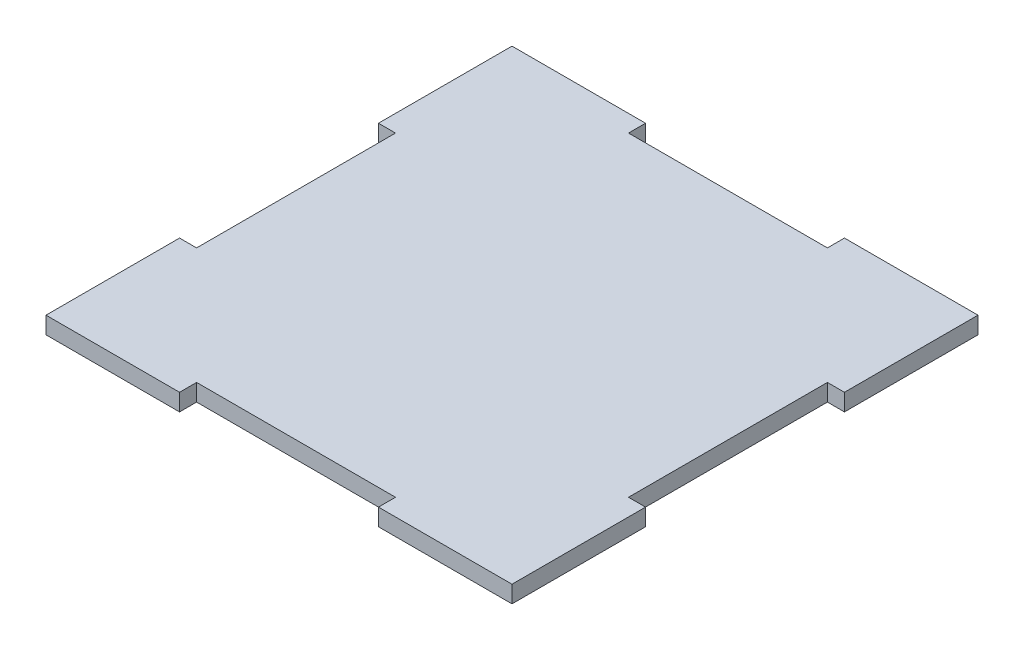
ISO-10303-21;
HEADER;
FILE_DESCRIPTION(('STEP AP214'),'2;1');
FILE_NAME('part.step','',(''),(''),'','','');
FILE_SCHEMA(('AUTOMOTIVE_DESIGN { 1 0 10303 214 1 1 1 1 }'));
ENDSEC;
DATA;
#1=APPLICATION_CONTEXT('core data for automotive mechanical design processes');
#2=APPLICATION_PROTOCOL_DEFINITION('international standard','automotive_design',2000,#1);
#3=PRODUCT_CONTEXT('',#1,'mechanical');
#4=PRODUCT('Part','Part','',(#3));
#5=PRODUCT_RELATED_PRODUCT_CATEGORY('part','',(#4));
#6=PRODUCT_DEFINITION_FORMATION('','',#4);
#7=PRODUCT_DEFINITION_CONTEXT('part definition',#1,'design');
#8=PRODUCT_DEFINITION('design','',#6,#7);
#9=PRODUCT_DEFINITION_SHAPE('','',#8);
#10=(LENGTH_UNIT() NAMED_UNIT(*) SI_UNIT(.MILLI.,.METRE.));
#11=(NAMED_UNIT(*) PLANE_ANGLE_UNIT() SI_UNIT($,.RADIAN.));
#12=(NAMED_UNIT(*) SI_UNIT($,.STERADIAN.) SOLID_ANGLE_UNIT());
#13=UNCERTAINTY_MEASURE_WITH_UNIT(LENGTH_MEASURE(1.E-05),#10,'distance_accuracy_value','');
#14=(GEOMETRIC_REPRESENTATION_CONTEXT(3) GLOBAL_UNCERTAINTY_ASSIGNED_CONTEXT((#13)) GLOBAL_UNIT_ASSIGNED_CONTEXT((#10,
#11,#12)) REPRESENTATION_CONTEXT('',''));
#15=CARTESIAN_POINT('',(0.,0.,0.));
#16=DIRECTION('',(0.,0.,1.));
#17=DIRECTION('',(1.,0.,0.));
#18=AXIS2_PLACEMENT_3D('',#15,#16,#17);
#19=CARTESIAN_POINT('',(41.,3.,-17.5));
#20=DIRECTION('',(-1.,0.,0.));
#21=DIRECTION('',(0.,0.,1.));
#22=AXIS2_PLACEMENT_3D('',#19,#20,#21);
#23=PLANE('',#22);
#24=DIRECTION('',(0.,0.,-1.));
#25=VECTOR('',#24,1.);
#26=CARTESIAN_POINT('',(41.,0.,-17.5));
#27=LINE('',#26,#25);
#28=CARTESIAN_POINT('',(41.,0.,-17.5));
#29=VERTEX_POINT('',#28);
#30=CARTESIAN_POINT('',(41.,0.,-41.));
#31=VERTEX_POINT('',#30);
#32=EDGE_CURVE('E204',#29,#31,#27,.T.);
#33=ORIENTED_EDGE('',*,*,#32,.T.);
#34=DIRECTION('',(0.,-1.,0.));
#35=VECTOR('',#34,1.);
#36=CARTESIAN_POINT('',(41.,3.,-41.));
#37=LINE('',#36,#35);
#38=CARTESIAN_POINT('',(41.,3.,-41.));
#39=VERTEX_POINT('',#38);
#40=EDGE_CURVE('E11',#39,#31,#37,.T.);
#41=ORIENTED_EDGE('',*,*,#40,.F.);
#42=DIRECTION('',(0.,0.,-1.));
#43=VECTOR('',#42,1.);
#44=CARTESIAN_POINT('',(41.,3.,-17.5));
#45=LINE('',#44,#43);
#46=CARTESIAN_POINT('',(41.,3.,-17.5));
#47=VERTEX_POINT('',#46);
#48=EDGE_CURVE('E242',#47,#39,#45,.T.);
#49=ORIENTED_EDGE('',*,*,#48,.F.);
#50=DIRECTION('',(0.,-1.,0.));
#51=VECTOR('',#50,1.);
#52=CARTESIAN_POINT('',(41.,3.,-17.5));
#53=LINE('',#52,#51);
#54=EDGE_CURVE('E200',#47,#29,#53,.T.);
#55=ORIENTED_EDGE('',*,*,#54,.T.);
#56=EDGE_LOOP('',(#33,#41,#49,#55));
#57=FACE_BOUND('',#56,.T.);
#58=ADVANCED_FACE('F36',(#57),#23,.F.);
#59=CARTESIAN_POINT('',(17.5,3.,-41.));
#60=DIRECTION('',(0.,0.,1.));
#61=DIRECTION('',(1.,0.,0.));
#62=AXIS2_PLACEMENT_3D('',#59,#60,#61);
#63=PLANE('',#62);
#64=DIRECTION('',(-1.,0.,0.));
#65=VECTOR('',#64,1.);
#66=CARTESIAN_POINT('',(17.5,0.,-41.));
#67=LINE('',#66,#65);
#68=CARTESIAN_POINT('',(17.5,0.,-41.));
#69=VERTEX_POINT('',#68);
#70=EDGE_CURVE('E207',#31,#69,#67,.T.);
#71=ORIENTED_EDGE('',*,*,#70,.T.);
#72=DIRECTION('',(0.,-1.,0.));
#73=VECTOR('',#72,1.);
#74=CARTESIAN_POINT('',(17.5,3.,-41.));
#75=LINE('',#74,#73);
#76=CARTESIAN_POINT('',(17.5,3.,-41.));
#77=VERTEX_POINT('',#76);
#78=EDGE_CURVE('E44',#77,#69,#75,.T.);
#79=ORIENTED_EDGE('',*,*,#78,.F.);
#80=DIRECTION('',(-1.,0.,0.));
#81=VECTOR('',#80,1.);
#82=CARTESIAN_POINT('',(17.5,3.,-41.));
#83=LINE('',#82,#81);
#84=EDGE_CURVE('E131',#39,#77,#83,.T.);
#85=ORIENTED_EDGE('',*,*,#84,.F.);
#86=ORIENTED_EDGE('',*,*,#40,.T.);
#87=EDGE_LOOP('',(#71,#79,#85,#86));
#88=FACE_BOUND('',#87,.T.);
#89=ADVANCED_FACE('F360',(#88),#63,.F.);
#90=CARTESIAN_POINT('',(17.5,3.,-38.));
#91=DIRECTION('',(1.,0.,0.));
#92=DIRECTION('',(0.,0.,-1.));
#93=AXIS2_PLACEMENT_3D('',#90,#91,#92);
#94=PLANE('',#93);
#95=DIRECTION('',(0.,0.,1.));
#96=VECTOR('',#95,1.);
#97=CARTESIAN_POINT('',(17.5,0.,-38.));
#98=LINE('',#97,#96);
#99=CARTESIAN_POINT('',(17.5,0.,-38.));
#100=VERTEX_POINT('',#99);
#101=EDGE_CURVE('E209',#69,#100,#98,.T.);
#102=ORIENTED_EDGE('',*,*,#101,.T.);
#103=DIRECTION('',(0.,-1.,0.));
#104=VECTOR('',#103,1.);
#105=CARTESIAN_POINT('',(17.5,3.,-38.));
#106=LINE('',#105,#104);
#107=CARTESIAN_POINT('',(17.5,3.,-38.));
#108=VERTEX_POINT('',#107);
#109=EDGE_CURVE('E285',#108,#100,#106,.T.);
#110=ORIENTED_EDGE('',*,*,#109,.F.);
#111=DIRECTION('',(0.,0.,1.));
#112=VECTOR('',#111,1.);
#113=CARTESIAN_POINT('',(17.5,3.,-38.));
#114=LINE('',#113,#112);
#115=EDGE_CURVE('E293',#77,#108,#114,.T.);
#116=ORIENTED_EDGE('',*,*,#115,.F.);
#117=ORIENTED_EDGE('',*,*,#78,.T.);
#118=EDGE_LOOP('',(#102,#110,#116,#117));
#119=FACE_BOUND('',#118,.T.);
#120=ADVANCED_FACE('F291',(#119),#94,.F.);
#121=CARTESIAN_POINT('',(-17.5,3.,-38.));
#122=DIRECTION('',(0.,0.,1.));
#123=DIRECTION('',(1.,0.,0.));
#124=AXIS2_PLACEMENT_3D('',#121,#122,#123);
#125=PLANE('',#124);
#126=DIRECTION('',(-1.,0.,0.));
#127=VECTOR('',#126,1.);
#128=CARTESIAN_POINT('',(-17.5,0.,-38.));
#129=LINE('',#128,#127);
#130=CARTESIAN_POINT('',(-17.5,0.,-38.));
#131=VERTEX_POINT('',#130);
#132=EDGE_CURVE('E211',#100,#131,#129,.T.);
#133=ORIENTED_EDGE('',*,*,#132,.T.);
#134=DIRECTION('',(0.,-1.,0.));
#135=VECTOR('',#134,1.);
#136=CARTESIAN_POINT('',(-17.5,3.,-38.));
#137=LINE('',#136,#135);
#138=CARTESIAN_POINT('',(-17.5,3.,-38.));
#139=VERTEX_POINT('',#138);
#140=EDGE_CURVE('E282',#139,#131,#137,.T.);
#141=ORIENTED_EDGE('',*,*,#140,.F.);
#142=DIRECTION('',(-1.,0.,0.));
#143=VECTOR('',#142,1.);
#144=CARTESIAN_POINT('',(-17.5,3.,-38.));
#145=LINE('',#144,#143);
#146=EDGE_CURVE('E311',#108,#139,#145,.T.);
#147=ORIENTED_EDGE('',*,*,#146,.F.);
#148=ORIENTED_EDGE('',*,*,#109,.T.);
#149=EDGE_LOOP('',(#133,#141,#147,#148));
#150=FACE_BOUND('',#149,.T.);
#151=ADVANCED_FACE('F302',(#150),#125,.F.);
#152=CARTESIAN_POINT('',(-17.5,3.,-41.));
#153=DIRECTION('',(-1.,0.,0.));
#154=DIRECTION('',(0.,0.,1.));
#155=AXIS2_PLACEMENT_3D('',#152,#153,#154);
#156=PLANE('',#155);
#157=DIRECTION('',(0.,0.,-1.));
#158=VECTOR('',#157,1.);
#159=CARTESIAN_POINT('',(-17.5,0.,-41.));
#160=LINE('',#159,#158);
#161=CARTESIAN_POINT('',(-17.5,0.,-41.));
#162=VERTEX_POINT('',#161);
#163=EDGE_CURVE('E213',#131,#162,#160,.T.);
#164=ORIENTED_EDGE('',*,*,#163,.T.);
#165=DIRECTION('',(0.,-1.,0.));
#166=VECTOR('',#165,1.);
#167=CARTESIAN_POINT('',(-17.5,3.,-41.));
#168=LINE('',#167,#166);
#169=CARTESIAN_POINT('',(-17.5,3.,-41.));
#170=VERTEX_POINT('',#169);
#171=EDGE_CURVE('E279',#170,#162,#168,.T.);
#172=ORIENTED_EDGE('',*,*,#171,.F.);
#173=DIRECTION('',(0.,0.,-1.));
#174=VECTOR('',#173,1.);
#175=CARTESIAN_POINT('',(-17.5,3.,-41.));
#176=LINE('',#175,#174);
#177=EDGE_CURVE('E308',#139,#170,#176,.T.);
#178=ORIENTED_EDGE('',*,*,#177,.F.);
#179=ORIENTED_EDGE('',*,*,#140,.T.);
#180=EDGE_LOOP('',(#164,#172,#178,#179));
#181=FACE_BOUND('',#180,.T.);
#182=ADVANCED_FACE('F306',(#181),#156,.F.);
#183=CARTESIAN_POINT('',(-41.,3.,-41.));
#184=DIRECTION('',(0.,0.,1.));
#185=DIRECTION('',(1.,0.,0.));
#186=AXIS2_PLACEMENT_3D('',#183,#184,#185);
#187=PLANE('',#186);
#188=DIRECTION('',(-1.,0.,0.));
#189=VECTOR('',#188,1.);
#190=CARTESIAN_POINT('',(-41.,0.,-41.));
#191=LINE('',#190,#189);
#192=CARTESIAN_POINT('',(-41.,0.,-41.));
#193=VERTEX_POINT('',#192);
#194=EDGE_CURVE('E215',#162,#193,#191,.T.);
#195=ORIENTED_EDGE('',*,*,#194,.T.);
#196=DIRECTION('',(0.,-1.,0.));
#197=VECTOR('',#196,1.);
#198=CARTESIAN_POINT('',(-41.,3.,-41.));
#199=LINE('',#198,#197);
#200=CARTESIAN_POINT('',(-41.,3.,-41.));
#201=VERTEX_POINT('',#200);
#202=EDGE_CURVE('E276',#201,#193,#199,.T.);
#203=ORIENTED_EDGE('',*,*,#202,.F.);
#204=DIRECTION('',(-1.,0.,0.));
#205=VECTOR('',#204,1.);
#206=CARTESIAN_POINT('',(-41.,3.,-41.));
#207=LINE('',#206,#205);
#208=EDGE_CURVE('E310',#170,#201,#207,.T.);
#209=ORIENTED_EDGE('',*,*,#208,.F.);
#210=ORIENTED_EDGE('',*,*,#171,.T.);
#211=EDGE_LOOP('',(#195,#203,#209,#210));
#212=FACE_BOUND('',#211,.T.);
#213=ADVANCED_FACE('F373',(#212),#187,.F.);
#214=CARTESIAN_POINT('',(-41.,3.,-17.5));
#215=DIRECTION('',(1.,0.,0.));
#216=DIRECTION('',(0.,0.,-1.));
#217=AXIS2_PLACEMENT_3D('',#214,#215,#216);
#218=PLANE('',#217);
#219=DIRECTION('',(0.,0.,1.));
#220=VECTOR('',#219,1.);
#221=CARTESIAN_POINT('',(-41.,0.,-17.5));
#222=LINE('',#221,#220);
#223=CARTESIAN_POINT('',(-41.,0.,-17.5));
#224=VERTEX_POINT('',#223);
#225=EDGE_CURVE('E217',#193,#224,#222,.T.);
#226=ORIENTED_EDGE('',*,*,#225,.T.);
#227=DIRECTION('',(0.,-1.,0.));
#228=VECTOR('',#227,1.);
#229=CARTESIAN_POINT('',(-41.,3.,-17.5));
#230=LINE('',#229,#228);
#231=CARTESIAN_POINT('',(-41.,3.,-17.5));
#232=VERTEX_POINT('',#231);
#233=EDGE_CURVE('E273',#232,#224,#230,.T.);
#234=ORIENTED_EDGE('',*,*,#233,.F.);
#235=DIRECTION('',(0.,0.,1.));
#236=VECTOR('',#235,1.);
#237=CARTESIAN_POINT('',(-41.,3.,-17.5));
#238=LINE('',#237,#236);
#239=EDGE_CURVE('E313',#201,#232,#238,.T.);
#240=ORIENTED_EDGE('',*,*,#239,.F.);
#241=ORIENTED_EDGE('',*,*,#202,.T.);
#242=EDGE_LOOP('',(#226,#234,#240,#241));
#243=FACE_BOUND('',#242,.T.);
#244=ADVANCED_FACE('F376',(#243),#218,.F.);
#245=CARTESIAN_POINT('',(-41.,3.,-17.5));
#246=DIRECTION('',(0.,0.,-1.));
#247=DIRECTION('',(-1.,0.,0.));
#248=AXIS2_PLACEMENT_3D('',#245,#246,#247);
#249=PLANE('',#248);
#250=DIRECTION('',(1.,0.,0.));
#251=VECTOR('',#250,1.);
#252=CARTESIAN_POINT('',(-41.,0.,-17.5));
#253=LINE('',#252,#251);
#254=CARTESIAN_POINT('',(-38.,0.,-17.5));
#255=VERTEX_POINT('',#254);
#256=EDGE_CURVE('E219',#224,#255,#253,.T.);
#257=ORIENTED_EDGE('',*,*,#256,.T.);
#258=DIRECTION('',(0.,-1.,0.));
#259=VECTOR('',#258,1.);
#260=CARTESIAN_POINT('',(-38.,3.,-17.5));
#261=LINE('',#260,#259);
#262=CARTESIAN_POINT('',(-38.,3.,-17.5));
#263=VERTEX_POINT('',#262);
#264=EDGE_CURVE('E270',#263,#255,#261,.T.);
#265=ORIENTED_EDGE('',*,*,#264,.F.);
#266=DIRECTION('',(1.,0.,0.));
#267=VECTOR('',#266,1.);
#268=CARTESIAN_POINT('',(-41.,3.,-17.5));
#269=LINE('',#268,#267);
#270=EDGE_CURVE('E319',#232,#263,#269,.T.);
#271=ORIENTED_EDGE('',*,*,#270,.F.);
#272=ORIENTED_EDGE('',*,*,#233,.T.);
#273=EDGE_LOOP('',(#257,#265,#271,#272));
#274=FACE_BOUND('',#273,.T.);
#275=ADVANCED_FACE('F380',(#274),#249,.F.);
#276=CARTESIAN_POINT('',(-38.,3.,-17.5));
#277=DIRECTION('',(1.,0.,0.));
#278=DIRECTION('',(0.,0.,-1.));
#279=AXIS2_PLACEMENT_3D('',#276,#277,#278);
#280=PLANE('',#279);
#281=DIRECTION('',(0.,0.,1.));
#282=VECTOR('',#281,1.);
#283=CARTESIAN_POINT('',(-38.,0.,-17.5));
#284=LINE('',#283,#282);
#285=CARTESIAN_POINT('',(-38.,0.,17.5));
#286=VERTEX_POINT('',#285);
#287=EDGE_CURVE('E221',#255,#286,#284,.T.);
#288=ORIENTED_EDGE('',*,*,#287,.T.);
#289=DIRECTION('',(0.,-1.,0.));
#290=VECTOR('',#289,1.);
#291=CARTESIAN_POINT('',(-38.,3.,17.5));
#292=LINE('',#291,#290);
#293=CARTESIAN_POINT('',(-38.,3.,17.5));
#294=VERTEX_POINT('',#293);
#295=EDGE_CURVE('E267',#294,#286,#292,.T.);
#296=ORIENTED_EDGE('',*,*,#295,.F.);
#297=DIRECTION('',(0.,0.,1.));
#298=VECTOR('',#297,1.);
#299=CARTESIAN_POINT('',(-38.,3.,-17.5));
#300=LINE('',#299,#298);
#301=EDGE_CURVE('E321',#263,#294,#300,.T.);
#302=ORIENTED_EDGE('',*,*,#301,.F.);
#303=ORIENTED_EDGE('',*,*,#264,.T.);
#304=EDGE_LOOP('',(#288,#296,#302,#303));
#305=FACE_BOUND('',#304,.T.);
#306=ADVANCED_FACE('F384',(#305),#280,.F.);
#307=CARTESIAN_POINT('',(-38.,3.,17.5));
#308=DIRECTION('',(0.,0.,1.));
#309=DIRECTION('',(1.,0.,0.));
#310=AXIS2_PLACEMENT_3D('',#307,#308,#309);
#311=PLANE('',#310);
#312=DIRECTION('',(-1.,0.,0.));
#313=VECTOR('',#312,1.);
#314=CARTESIAN_POINT('',(-38.,0.,17.5));
#315=LINE('',#314,#313);
#316=CARTESIAN_POINT('',(-41.,0.,17.5));
#317=VERTEX_POINT('',#316);
#318=EDGE_CURVE('E223',#286,#317,#315,.T.);
#319=ORIENTED_EDGE('',*,*,#318,.T.);
#320=DIRECTION('',(0.,-1.,0.));
#321=VECTOR('',#320,1.);
#322=CARTESIAN_POINT('',(-41.,3.,17.5));
#323=LINE('',#322,#321);
#324=CARTESIAN_POINT('',(-41.,3.,17.5));
#325=VERTEX_POINT('',#324);
#326=EDGE_CURVE('E264',#325,#317,#323,.T.);
#327=ORIENTED_EDGE('',*,*,#326,.F.);
#328=DIRECTION('',(-1.,0.,0.));
#329=VECTOR('',#328,1.);
#330=CARTESIAN_POINT('',(-38.,3.,17.5));
#331=LINE('',#330,#329);
#332=EDGE_CURVE('E323',#294,#325,#331,.T.);
#333=ORIENTED_EDGE('',*,*,#332,.F.);
#334=ORIENTED_EDGE('',*,*,#295,.T.);
#335=EDGE_LOOP('',(#319,#327,#333,#334));
#336=FACE_BOUND('',#335,.T.);
#337=ADVANCED_FACE('F388',(#336),#311,.F.);
#338=CARTESIAN_POINT('',(-41.,3.,41.));
#339=DIRECTION('',(1.,0.,0.));
#340=DIRECTION('',(0.,0.,-1.));
#341=AXIS2_PLACEMENT_3D('',#338,#339,#340);
#342=PLANE('',#341);
#343=DIRECTION('',(0.,0.,1.));
#344=VECTOR('',#343,1.);
#345=CARTESIAN_POINT('',(-41.,0.,41.));
#346=LINE('',#345,#344);
#347=CARTESIAN_POINT('',(-41.,0.,41.));
#348=VERTEX_POINT('',#347);
#349=EDGE_CURVE('E225',#317,#348,#346,.T.);
#350=ORIENTED_EDGE('',*,*,#349,.T.);
#351=DIRECTION('',(0.,-1.,0.));
#352=VECTOR('',#351,1.);
#353=CARTESIAN_POINT('',(-41.,3.,41.));
#354=LINE('',#353,#352);
#355=CARTESIAN_POINT('',(-41.,3.,41.));
#356=VERTEX_POINT('',#355);
#357=EDGE_CURVE('E261',#356,#348,#354,.T.);
#358=ORIENTED_EDGE('',*,*,#357,.F.);
#359=DIRECTION('',(0.,0.,1.));
#360=VECTOR('',#359,1.);
#361=CARTESIAN_POINT('',(-41.,3.,41.));
#362=LINE('',#361,#360);
#363=EDGE_CURVE('E325',#325,#356,#362,.T.);
#364=ORIENTED_EDGE('',*,*,#363,.F.);
#365=ORIENTED_EDGE('',*,*,#326,.T.);
#366=EDGE_LOOP('',(#350,#358,#364,#365));
#367=FACE_BOUND('',#366,.T.);
#368=ADVANCED_FACE('F392',(#367),#342,.F.);
#369=CARTESIAN_POINT('',(-41.,3.,41.));
#370=DIRECTION('',(0.,0.,-1.));
#371=DIRECTION('',(-1.,0.,0.));
#372=AXIS2_PLACEMENT_3D('',#369,#370,#371);
#373=PLANE('',#372);
#374=DIRECTION('',(1.,0.,0.));
#375=VECTOR('',#374,1.);
#376=CARTESIAN_POINT('',(-41.,0.,41.));
#377=LINE('',#376,#375);
#378=CARTESIAN_POINT('',(-17.5,0.,41.));
#379=VERTEX_POINT('',#378);
#380=EDGE_CURVE('E227',#348,#379,#377,.T.);
#381=ORIENTED_EDGE('',*,*,#380,.T.);
#382=DIRECTION('',(0.,-1.,0.));
#383=VECTOR('',#382,1.);
#384=CARTESIAN_POINT('',(-17.5,3.,41.));
#385=LINE('',#384,#383);
#386=CARTESIAN_POINT('',(-17.5,3.,41.));
#387=VERTEX_POINT('',#386);
#388=EDGE_CURVE('E258',#387,#379,#385,.T.);
#389=ORIENTED_EDGE('',*,*,#388,.F.);
#390=DIRECTION('',(1.,0.,0.));
#391=VECTOR('',#390,1.);
#392=CARTESIAN_POINT('',(-41.,3.,41.));
#393=LINE('',#392,#391);
#394=EDGE_CURVE('E327',#356,#387,#393,.T.);
#395=ORIENTED_EDGE('',*,*,#394,.F.);
#396=ORIENTED_EDGE('',*,*,#357,.T.);
#397=EDGE_LOOP('',(#381,#389,#395,#396));
#398=FACE_BOUND('',#397,.T.);
#399=ADVANCED_FACE('F396',(#398),#373,.F.);
#400=CARTESIAN_POINT('',(-17.5,3.,38.));
#401=DIRECTION('',(-1.,0.,0.));
#402=DIRECTION('',(0.,0.,1.));
#403=AXIS2_PLACEMENT_3D('',#400,#401,#402);
#404=PLANE('',#403);
#405=DIRECTION('',(0.,0.,-1.));
#406=VECTOR('',#405,1.);
#407=CARTESIAN_POINT('',(-17.5,0.,38.));
#408=LINE('',#407,#406);
#409=CARTESIAN_POINT('',(-17.5,0.,38.));
#410=VERTEX_POINT('',#409);
#411=EDGE_CURVE('E229',#379,#410,#408,.T.);
#412=ORIENTED_EDGE('',*,*,#411,.T.);
#413=DIRECTION('',(0.,-1.,0.));
#414=VECTOR('',#413,1.);
#415=CARTESIAN_POINT('',(-17.5,3.,38.));
#416=LINE('',#415,#414);
#417=CARTESIAN_POINT('',(-17.5,3.,38.));
#418=VERTEX_POINT('',#417);
#419=EDGE_CURVE('E255',#418,#410,#416,.T.);
#420=ORIENTED_EDGE('',*,*,#419,.F.);
#421=DIRECTION('',(0.,0.,-1.));
#422=VECTOR('',#421,1.);
#423=CARTESIAN_POINT('',(-17.5,3.,38.));
#424=LINE('',#423,#422);
#425=EDGE_CURVE('E329',#387,#418,#424,.T.);
#426=ORIENTED_EDGE('',*,*,#425,.F.);
#427=ORIENTED_EDGE('',*,*,#388,.T.);
#428=EDGE_LOOP('',(#412,#420,#426,#427));
#429=FACE_BOUND('',#428,.T.);
#430=ADVANCED_FACE('F400',(#429),#404,.F.);
#431=CARTESIAN_POINT('',(17.5,3.,38.));
#432=DIRECTION('',(0.,0.,-1.));
#433=DIRECTION('',(-1.,0.,0.));
#434=AXIS2_PLACEMENT_3D('',#431,#432,#433);
#435=PLANE('',#434);
#436=DIRECTION('',(1.,0.,0.));
#437=VECTOR('',#436,1.);
#438=CARTESIAN_POINT('',(17.5,0.,38.));
#439=LINE('',#438,#437);
#440=CARTESIAN_POINT('',(17.5,0.,38.));
#441=VERTEX_POINT('',#440);
#442=EDGE_CURVE('E231',#410,#441,#439,.T.);
#443=ORIENTED_EDGE('',*,*,#442,.T.);
#444=DIRECTION('',(0.,-1.,0.));
#445=VECTOR('',#444,1.);
#446=CARTESIAN_POINT('',(17.5,3.,38.));
#447=LINE('',#446,#445);
#448=CARTESIAN_POINT('',(17.5,3.,38.));
#449=VERTEX_POINT('',#448);
#450=EDGE_CURVE('E252',#449,#441,#447,.T.);
#451=ORIENTED_EDGE('',*,*,#450,.F.);
#452=DIRECTION('',(1.,0.,0.));
#453=VECTOR('',#452,1.);
#454=CARTESIAN_POINT('',(17.5,3.,38.));
#455=LINE('',#454,#453);
#456=EDGE_CURVE('E331',#418,#449,#455,.T.);
#457=ORIENTED_EDGE('',*,*,#456,.F.);
#458=ORIENTED_EDGE('',*,*,#419,.T.);
#459=EDGE_LOOP('',(#443,#451,#457,#458));
#460=FACE_BOUND('',#459,.T.);
#461=ADVANCED_FACE('F404',(#460),#435,.F.);
#462=CARTESIAN_POINT('',(17.5,3.,41.));
#463=DIRECTION('',(1.,0.,0.));
#464=DIRECTION('',(0.,0.,-1.));
#465=AXIS2_PLACEMENT_3D('',#462,#463,#464);
#466=PLANE('',#465);
#467=DIRECTION('',(0.,0.,1.));
#468=VECTOR('',#467,1.);
#469=CARTESIAN_POINT('',(17.5,0.,41.));
#470=LINE('',#469,#468);
#471=CARTESIAN_POINT('',(17.5,0.,41.));
#472=VERTEX_POINT('',#471);
#473=EDGE_CURVE('E233',#441,#472,#470,.T.);
#474=ORIENTED_EDGE('',*,*,#473,.T.);
#475=DIRECTION('',(0.,-1.,0.));
#476=VECTOR('',#475,1.);
#477=CARTESIAN_POINT('',(17.5,3.,41.));
#478=LINE('',#477,#476);
#479=CARTESIAN_POINT('',(17.5,3.,41.));
#480=VERTEX_POINT('',#479);
#481=EDGE_CURVE('E249',#480,#472,#478,.T.);
#482=ORIENTED_EDGE('',*,*,#481,.F.);
#483=DIRECTION('',(0.,0.,1.));
#484=VECTOR('',#483,1.);
#485=CARTESIAN_POINT('',(17.5,3.,41.));
#486=LINE('',#485,#484);
#487=EDGE_CURVE('E333',#449,#480,#486,.T.);
#488=ORIENTED_EDGE('',*,*,#487,.F.);
#489=ORIENTED_EDGE('',*,*,#450,.T.);
#490=EDGE_LOOP('',(#474,#482,#488,#489));
#491=FACE_BOUND('',#490,.T.);
#492=ADVANCED_FACE('F408',(#491),#466,.F.);
#493=CARTESIAN_POINT('',(17.5,3.,41.));
#494=DIRECTION('',(0.,0.,-1.));
#495=DIRECTION('',(-1.,0.,0.));
#496=AXIS2_PLACEMENT_3D('',#493,#494,#495);
#497=PLANE('',#496);
#498=DIRECTION('',(1.,0.,0.));
#499=VECTOR('',#498,1.);
#500=CARTESIAN_POINT('',(17.5,0.,41.));
#501=LINE('',#500,#499);
#502=CARTESIAN_POINT('',(41.,0.,41.));
#503=VERTEX_POINT('',#502);
#504=EDGE_CURVE('E235',#472,#503,#501,.T.);
#505=ORIENTED_EDGE('',*,*,#504,.T.);
#506=DIRECTION('',(0.,-1.,0.));
#507=VECTOR('',#506,1.);
#508=CARTESIAN_POINT('',(41.,3.,41.));
#509=LINE('',#508,#507);
#510=CARTESIAN_POINT('',(41.,3.,41.));
#511=VERTEX_POINT('',#510);
#512=EDGE_CURVE('E246',#511,#503,#509,.T.);
#513=ORIENTED_EDGE('',*,*,#512,.F.);
#514=DIRECTION('',(1.,0.,0.));
#515=VECTOR('',#514,1.);
#516=CARTESIAN_POINT('',(17.5,3.,41.));
#517=LINE('',#516,#515);
#518=EDGE_CURVE('E335',#480,#511,#517,.T.);
#519=ORIENTED_EDGE('',*,*,#518,.F.);
#520=ORIENTED_EDGE('',*,*,#481,.T.);
#521=EDGE_LOOP('',(#505,#513,#519,#520));
#522=FACE_BOUND('',#521,.T.);
#523=ADVANCED_FACE('F341',(#522),#497,.F.);
#524=CARTESIAN_POINT('',(41.,3.,41.));
#525=DIRECTION('',(-1.,0.,0.));
#526=DIRECTION('',(0.,0.,1.));
#527=AXIS2_PLACEMENT_3D('',#524,#525,#526);
#528=PLANE('',#527);
#529=DIRECTION('',(0.,0.,-1.));
#530=VECTOR('',#529,1.);
#531=CARTESIAN_POINT('',(41.,0.,41.));
#532=LINE('',#531,#530);
#533=CARTESIAN_POINT('',(41.,0.,17.5));
#534=VERTEX_POINT('',#533);
#535=EDGE_CURVE('E237',#503,#534,#532,.T.);
#536=ORIENTED_EDGE('',*,*,#535,.T.);
#537=DIRECTION('',(0.,-1.,0.));
#538=VECTOR('',#537,1.);
#539=CARTESIAN_POINT('',(41.,3.,17.5));
#540=LINE('',#539,#538);
#541=CARTESIAN_POINT('',(41.,3.,17.5));
#542=VERTEX_POINT('',#541);
#543=EDGE_CURVE('E195',#542,#534,#540,.T.);
#544=ORIENTED_EDGE('',*,*,#543,.F.);
#545=DIRECTION('',(0.,0.,-1.));
#546=VECTOR('',#545,1.);
#547=CARTESIAN_POINT('',(41.,3.,41.));
#548=LINE('',#547,#546);
#549=EDGE_CURVE('E186',#511,#542,#548,.T.);
#550=ORIENTED_EDGE('',*,*,#549,.F.);
#551=ORIENTED_EDGE('',*,*,#512,.T.);
#552=EDGE_LOOP('',(#536,#544,#550,#551));
#553=FACE_BOUND('',#552,.T.);
#554=ADVANCED_FACE('F345',(#553),#528,.F.);
#555=CARTESIAN_POINT('',(38.,3.,17.5));
#556=DIRECTION('',(0.,0.,1.));
#557=DIRECTION('',(1.,0.,0.));
#558=AXIS2_PLACEMENT_3D('',#555,#556,#557);
#559=PLANE('',#558);
#560=DIRECTION('',(-1.,0.,0.));
#561=VECTOR('',#560,1.);
#562=CARTESIAN_POINT('',(38.,0.,17.5));
#563=LINE('',#562,#561);
#564=CARTESIAN_POINT('',(38.,0.,17.5));
#565=VERTEX_POINT('',#564);
#566=EDGE_CURVE('E194',#534,#565,#563,.T.);
#567=ORIENTED_EDGE('',*,*,#566,.T.);
#568=DIRECTION('',(0.,-1.,0.));
#569=VECTOR('',#568,1.);
#570=CARTESIAN_POINT('',(38.,3.,17.5));
#571=LINE('',#570,#569);
#572=CARTESIAN_POINT('',(38.,3.,17.5));
#573=VERTEX_POINT('',#572);
#574=EDGE_CURVE('E191',#573,#565,#571,.T.);
#575=ORIENTED_EDGE('',*,*,#574,.F.);
#576=DIRECTION('',(-1.,0.,0.));
#577=VECTOR('',#576,1.);
#578=CARTESIAN_POINT('',(38.,3.,17.5));
#579=LINE('',#578,#577);
#580=EDGE_CURVE('E180',#542,#573,#579,.T.);
#581=ORIENTED_EDGE('',*,*,#580,.F.);
#582=ORIENTED_EDGE('',*,*,#543,.T.);
#583=EDGE_LOOP('',(#567,#575,#581,#582));
#584=FACE_BOUND('',#583,.T.);
#585=ADVANCED_FACE('F192',(#584),#559,.F.);
#586=CARTESIAN_POINT('',(38.,3.,-17.5));
#587=DIRECTION('',(-1.,0.,0.));
#588=DIRECTION('',(0.,0.,1.));
#589=AXIS2_PLACEMENT_3D('',#586,#587,#588);
#590=PLANE('',#589);
#591=DIRECTION('',(0.,0.,-1.));
#592=VECTOR('',#591,1.);
#593=CARTESIAN_POINT('',(38.,0.,-17.5));
#594=LINE('',#593,#592);
#595=CARTESIAN_POINT('',(38.,0.,-17.5));
#596=VERTEX_POINT('',#595);
#597=EDGE_CURVE('E117',#565,#596,#594,.T.);
#598=ORIENTED_EDGE('',*,*,#597,.T.);
#599=DIRECTION('',(0.,-1.,0.));
#600=VECTOR('',#599,1.);
#601=CARTESIAN_POINT('',(38.,3.,-17.5));
#602=LINE('',#601,#600);
#603=CARTESIAN_POINT('',(38.,3.,-17.5));
#604=VERTEX_POINT('',#603);
#605=EDGE_CURVE('E196',#604,#596,#602,.T.);
#606=ORIENTED_EDGE('',*,*,#605,.F.);
#607=DIRECTION('',(0.,0.,-1.));
#608=VECTOR('',#607,1.);
#609=CARTESIAN_POINT('',(38.,3.,-17.5));
#610=LINE('',#609,#608);
#611=EDGE_CURVE('E184',#573,#604,#610,.T.);
#612=ORIENTED_EDGE('',*,*,#611,.F.);
#613=ORIENTED_EDGE('',*,*,#574,.T.);
#614=EDGE_LOOP('',(#598,#606,#612,#613));
#615=FACE_BOUND('',#614,.T.);
#616=ADVANCED_FACE('F198',(#615),#590,.F.);
#617=CARTESIAN_POINT('',(41.,3.,-17.5));
#618=DIRECTION('',(0.,0.,-1.));
#619=DIRECTION('',(-1.,0.,0.));
#620=AXIS2_PLACEMENT_3D('',#617,#618,#619);
#621=PLANE('',#620);
#622=DIRECTION('',(1.,0.,0.));
#623=VECTOR('',#622,1.);
#624=CARTESIAN_POINT('',(41.,0.,-17.5));
#625=LINE('',#624,#623);
#626=EDGE_CURVE('E123',#596,#29,#625,.T.);
#627=ORIENTED_EDGE('',*,*,#626,.T.);
#628=ORIENTED_EDGE('',*,*,#54,.F.);
#629=DIRECTION('',(1.,0.,0.));
#630=VECTOR('',#629,1.);
#631=CARTESIAN_POINT('',(41.,3.,-17.5));
#632=LINE('',#631,#630);
#633=EDGE_CURVE('E52',#604,#47,#632,.T.);
#634=ORIENTED_EDGE('',*,*,#633,.F.);
#635=ORIENTED_EDGE('',*,*,#605,.T.);
#636=EDGE_LOOP('',(#627,#628,#634,#635));
#637=FACE_BOUND('',#636,.T.);
#638=ADVANCED_FACE('F349',(#637),#621,.F.);
#639=CARTESIAN_POINT('',(0.,3.,0.));
#640=DIRECTION('',(0.,-1.,0.));
#641=DIRECTION('',(0.,0.,-1.));
#642=AXIS2_PLACEMENT_3D('',#639,#640,#641);
#643=PLANE('',#642);
#644=ORIENTED_EDGE('',*,*,#48,.T.);
#645=ORIENTED_EDGE('',*,*,#84,.T.);
#646=ORIENTED_EDGE('',*,*,#115,.T.);
#647=ORIENTED_EDGE('',*,*,#146,.T.);
#648=ORIENTED_EDGE('',*,*,#177,.T.);
#649=ORIENTED_EDGE('',*,*,#208,.T.);
#650=ORIENTED_EDGE('',*,*,#239,.T.);
#651=ORIENTED_EDGE('',*,*,#270,.T.);
#652=ORIENTED_EDGE('',*,*,#301,.T.);
#653=ORIENTED_EDGE('',*,*,#332,.T.);
#654=ORIENTED_EDGE('',*,*,#363,.T.);
#655=ORIENTED_EDGE('',*,*,#394,.T.);
#656=ORIENTED_EDGE('',*,*,#425,.T.);
#657=ORIENTED_EDGE('',*,*,#456,.T.);
#658=ORIENTED_EDGE('',*,*,#487,.T.);
#659=ORIENTED_EDGE('',*,*,#518,.T.);
#660=ORIENTED_EDGE('',*,*,#549,.T.);
#661=ORIENTED_EDGE('',*,*,#580,.T.);
#662=ORIENTED_EDGE('',*,*,#611,.T.);
#663=ORIENTED_EDGE('',*,*,#633,.T.);
#664=EDGE_LOOP('',(#644,#645,#646,#647,#648,#649,#650,#651,#652,#653,#654,#655,#656,#657,#658,
#659,#660,#661,#662,#663));
#665=FACE_BOUND('',#664,.T.);
#666=ADVANCED_FACE('F182',(#665),#643,.F.);
#667=CARTESIAN_POINT('',(0.,0.,0.));
#668=DIRECTION('',(0.,-1.,0.));
#669=DIRECTION('',(0.,0.,-1.));
#670=AXIS2_PLACEMENT_3D('',#667,#668,#669);
#671=PLANE('',#670);
#672=ORIENTED_EDGE('',*,*,#32,.F.);
#673=ORIENTED_EDGE('',*,*,#626,.F.);
#674=ORIENTED_EDGE('',*,*,#597,.F.);
#675=ORIENTED_EDGE('',*,*,#566,.F.);
#676=ORIENTED_EDGE('',*,*,#535,.F.);
#677=ORIENTED_EDGE('',*,*,#504,.F.);
#678=ORIENTED_EDGE('',*,*,#473,.F.);
#679=ORIENTED_EDGE('',*,*,#442,.F.);
#680=ORIENTED_EDGE('',*,*,#411,.F.);
#681=ORIENTED_EDGE('',*,*,#380,.F.);
#682=ORIENTED_EDGE('',*,*,#349,.F.);
#683=ORIENTED_EDGE('',*,*,#318,.F.);
#684=ORIENTED_EDGE('',*,*,#287,.F.);
#685=ORIENTED_EDGE('',*,*,#256,.F.);
#686=ORIENTED_EDGE('',*,*,#225,.F.);
#687=ORIENTED_EDGE('',*,*,#194,.F.);
#688=ORIENTED_EDGE('',*,*,#163,.F.);
#689=ORIENTED_EDGE('',*,*,#132,.F.);
#690=ORIENTED_EDGE('',*,*,#101,.F.);
#691=ORIENTED_EDGE('',*,*,#70,.F.);
#692=EDGE_LOOP('',(#672,#673,#674,#675,#676,#677,#678,#679,#680,#681,#682,#683,#684,#685,#686,
#687,#688,#689,#690,#691));
#693=FACE_BOUND('',#692,.T.);
#694=ADVANCED_FACE('F297',(#693),#671,.T.);
#695=CLOSED_SHELL('',(#58,#89,#120,#151,#182,#213,#244,#275,#306,#337,#368,#399,#430,#461,#492,
#523,#554,#585,#616,#638,#666,#694));
#696=MANIFOLD_SOLID_BREP('B2',#695);
#697=ADVANCED_BREP_SHAPE_REPRESENTATION('',(#18,#696),#14);
#698=SHAPE_DEFINITION_REPRESENTATION(#9,#697);
ENDSEC;
END-ISO-10303-21;
